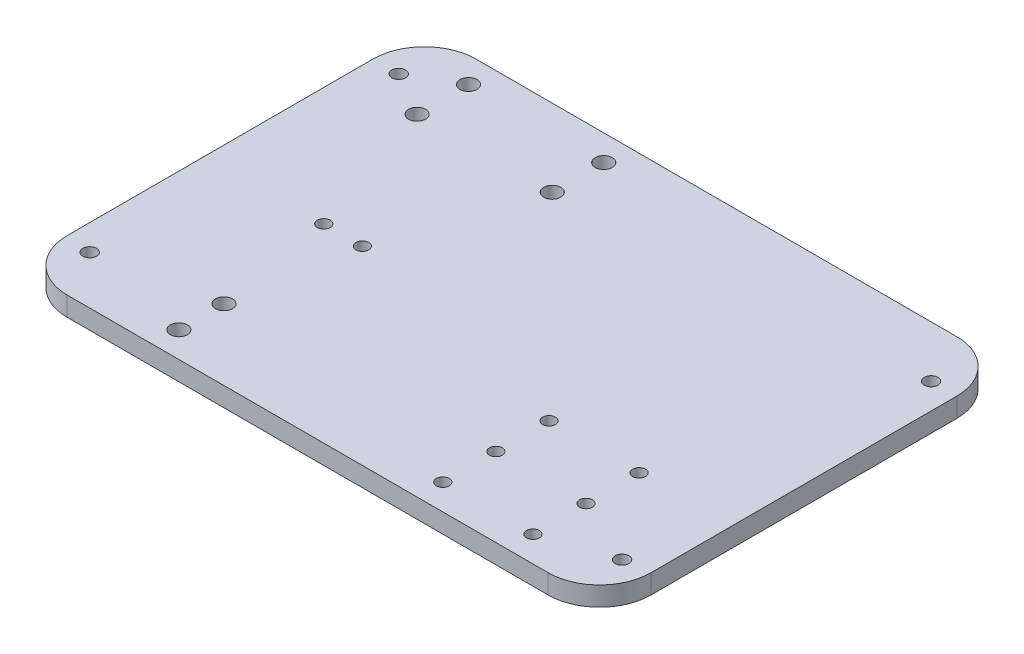
ISO-10303-21;
HEADER;
FILE_DESCRIPTION(('STEP AP214'),'2;1');
FILE_NAME('part.step','',(''),(''),'','','');
FILE_SCHEMA(('AUTOMOTIVE_DESIGN { 1 0 10303 214 1 1 1 1 }'));
ENDSEC;
DATA;
#1=APPLICATION_CONTEXT('core data for automotive mechanical design processes');
#2=APPLICATION_PROTOCOL_DEFINITION('international standard','automotive_design',2000,#1);
#3=PRODUCT_CONTEXT('',#1,'mechanical');
#4=PRODUCT('Part','Part','',(#3));
#5=PRODUCT_RELATED_PRODUCT_CATEGORY('part','',(#4));
#6=PRODUCT_DEFINITION_FORMATION('','',#4);
#7=PRODUCT_DEFINITION_CONTEXT('part definition',#1,'design');
#8=PRODUCT_DEFINITION('design','',#6,#7);
#9=PRODUCT_DEFINITION_SHAPE('','',#8);
#10=(LENGTH_UNIT() NAMED_UNIT(*) SI_UNIT(.MILLI.,.METRE.));
#11=(NAMED_UNIT(*) PLANE_ANGLE_UNIT() SI_UNIT($,.RADIAN.));
#12=(NAMED_UNIT(*) SI_UNIT($,.STERADIAN.) SOLID_ANGLE_UNIT());
#13=UNCERTAINTY_MEASURE_WITH_UNIT(LENGTH_MEASURE(1.E-05),#10,'distance_accuracy_value','');
#14=(GEOMETRIC_REPRESENTATION_CONTEXT(3) GLOBAL_UNCERTAINTY_ASSIGNED_CONTEXT((#13)) GLOBAL_UNIT_ASSIGNED_CONTEXT((#10,
#11,#12)) REPRESENTATION_CONTEXT('',''));
#15=CARTESIAN_POINT('',(0.,0.,0.));
#16=DIRECTION('',(0.,0.,1.));
#17=DIRECTION('',(1.,0.,0.));
#18=AXIS2_PLACEMENT_3D('',#15,#16,#17);
#19=CARTESIAN_POINT('',(143.99895,9.525,100.80625));
#20=DIRECTION('',(-1.,0.,0.));
#21=DIRECTION('',(0.,0.,1.));
#22=AXIS2_PLACEMENT_3D('',#19,#20,#21);
#23=PLANE('',#22);
#24=DIRECTION('',(0.,0.,-1.));
#25=VECTOR('',#24,1.);
#26=CARTESIAN_POINT('',(143.99895,0.,100.80625));
#27=LINE('',#26,#25);
#28=CARTESIAN_POINT('',(143.99895,0.,75.40625));
#29=VERTEX_POINT('',#28);
#30=CARTESIAN_POINT('',(143.99895,0.,-75.40625));
#31=VERTEX_POINT('',#30);
#32=EDGE_CURVE('E132',#29,#31,#27,.T.);
#33=ORIENTED_EDGE('',*,*,#32,.T.);
#34=DIRECTION('',(0.,-1.,0.));
#35=VECTOR('',#34,1.);
#36=CARTESIAN_POINT('',(143.99895,9.525,-75.40625));
#37=LINE('',#36,#35);
#38=CARTESIAN_POINT('',(143.99895,9.525,-75.40625));
#39=VERTEX_POINT('',#38);
#40=EDGE_CURVE('E155',#31,#39,#37,.F.);
#41=ORIENTED_EDGE('',*,*,#40,.T.);
#42=DIRECTION('',(0.,0.,-1.));
#43=VECTOR('',#42,1.);
#44=CARTESIAN_POINT('',(143.99895,9.525,100.80625));
#45=LINE('',#44,#43);
#46=CARTESIAN_POINT('',(143.99895,9.525,75.40625));
#47=VERTEX_POINT('',#46);
#48=EDGE_CURVE('E130',#47,#39,#45,.T.);
#49=ORIENTED_EDGE('',*,*,#48,.F.);
#50=DIRECTION('',(0.,-1.,0.));
#51=VECTOR('',#50,1.);
#52=CARTESIAN_POINT('',(143.99895,9.525,75.40625));
#53=LINE('',#52,#51);
#54=EDGE_CURVE('E152',#47,#29,#53,.T.);
#55=ORIENTED_EDGE('',*,*,#54,.T.);
#56=EDGE_LOOP('',(#33,#41,#49,#55));
#57=FACE_BOUND('',#56,.T.);
#58=ADVANCED_FACE('F35',(#57),#23,.F.);
#59=CARTESIAN_POINT('',(-143.99895,9.525,-100.80625));
#60=DIRECTION('',(0.,0.,1.));
#61=DIRECTION('',(1.,0.,0.));
#62=AXIS2_PLACEMENT_3D('',#59,#60,#61);
#63=PLANE('',#62);
#64=DIRECTION('',(-1.,0.,0.));
#65=VECTOR('',#64,1.);
#66=CARTESIAN_POINT('',(-143.99895,0.,-100.80625));
#67=LINE('',#66,#65);
#68=CARTESIAN_POINT('',(118.59895,0.,-100.80625));
#69=VERTEX_POINT('',#68);
#70=CARTESIAN_POINT('',(-118.59895,0.,-100.80625));
#71=VERTEX_POINT('',#70);
#72=EDGE_CURVE('E128',#69,#71,#67,.T.);
#73=ORIENTED_EDGE('',*,*,#72,.T.);
#74=DIRECTION('',(0.,-1.,0.));
#75=VECTOR('',#74,1.);
#76=CARTESIAN_POINT('',(-118.59895,9.525,-100.80625));
#77=LINE('',#76,#75);
#78=CARTESIAN_POINT('',(-118.59895,9.525,-100.80625));
#79=VERTEX_POINT('',#78);
#80=EDGE_CURVE('E107',#71,#79,#77,.F.);
#81=ORIENTED_EDGE('',*,*,#80,.T.);
#82=DIRECTION('',(-1.,0.,0.));
#83=VECTOR('',#82,1.);
#84=CARTESIAN_POINT('',(-143.99895,9.525,-100.80625));
#85=LINE('',#84,#83);
#86=CARTESIAN_POINT('',(118.59895,9.525,-100.80625));
#87=VERTEX_POINT('',#86);
#88=EDGE_CURVE('E253',#87,#79,#85,.T.);
#89=ORIENTED_EDGE('',*,*,#88,.F.);
#90=DIRECTION('',(0.,-1.,0.));
#91=VECTOR('',#90,1.);
#92=CARTESIAN_POINT('',(118.59895,9.525,-100.80625));
#93=LINE('',#92,#91);
#94=EDGE_CURVE('E112',#87,#69,#93,.T.);
#95=ORIENTED_EDGE('',*,*,#94,.T.);
#96=EDGE_LOOP('',(#73,#81,#89,#95));
#97=FACE_BOUND('',#96,.T.);
#98=ADVANCED_FACE('F270',(#97),#63,.F.);
#99=CARTESIAN_POINT('',(-143.99895,9.525,100.80625));
#100=DIRECTION('',(1.,0.,0.));
#101=DIRECTION('',(0.,0.,-1.));
#102=AXIS2_PLACEMENT_3D('',#99,#100,#101);
#103=PLANE('',#102);
#104=DIRECTION('',(0.,0.,1.));
#105=VECTOR('',#104,1.);
#106=CARTESIAN_POINT('',(-143.99895,9.525,100.80625));
#107=LINE('',#106,#105);
#108=CARTESIAN_POINT('',(-143.99895,9.525,-75.40625));
#109=VERTEX_POINT('',#108);
#110=CARTESIAN_POINT('',(-143.99895,9.525,75.40625));
#111=VERTEX_POINT('',#110);
#112=EDGE_CURVE('E121',#109,#111,#107,.T.);
#113=ORIENTED_EDGE('',*,*,#112,.F.);
#114=DIRECTION('',(0.,-1.,0.));
#115=VECTOR('',#114,1.);
#116=CARTESIAN_POINT('',(-143.99895,9.525,-75.40625));
#117=LINE('',#116,#115);
#118=CARTESIAN_POINT('',(-143.99895,0.,-75.40625));
#119=VERTEX_POINT('',#118);
#120=EDGE_CURVE('E106',#109,#119,#117,.T.);
#121=ORIENTED_EDGE('',*,*,#120,.T.);
#122=DIRECTION('',(0.,0.,1.));
#123=VECTOR('',#122,1.);
#124=CARTESIAN_POINT('',(-143.99895,0.,100.80625));
#125=LINE('',#124,#123);
#126=CARTESIAN_POINT('',(-143.99895,0.,75.40625));
#127=VERTEX_POINT('',#126);
#128=EDGE_CURVE('E119',#119,#127,#125,.T.);
#129=ORIENTED_EDGE('',*,*,#128,.T.);
#130=DIRECTION('',(0.,-1.,0.));
#131=VECTOR('',#130,1.);
#132=CARTESIAN_POINT('',(-143.99895,9.525,75.40625));
#133=LINE('',#132,#131);
#134=EDGE_CURVE('E123',#127,#111,#133,.F.);
#135=ORIENTED_EDGE('',*,*,#134,.T.);
#136=EDGE_LOOP('',(#113,#121,#129,#135));
#137=FACE_BOUND('',#136,.T.);
#138=ADVANCED_FACE('F118',(#137),#103,.F.);
#139=CARTESIAN_POINT('',(-143.99895,9.525,100.80625));
#140=DIRECTION('',(0.,0.,-1.));
#141=DIRECTION('',(-1.,0.,0.));
#142=AXIS2_PLACEMENT_3D('',#139,#140,#141);
#143=PLANE('',#142);
#144=DIRECTION('',(1.,0.,0.));
#145=VECTOR('',#144,1.);
#146=CARTESIAN_POINT('',(-143.99895,0.,100.80625));
#147=LINE('',#146,#145);
#148=CARTESIAN_POINT('',(-118.59895,0.,100.80625));
#149=VERTEX_POINT('',#148);
#150=CARTESIAN_POINT('',(118.59895,0.,100.80625));
#151=VERTEX_POINT('',#150);
#152=EDGE_CURVE('E127',#149,#151,#147,.T.);
#153=ORIENTED_EDGE('',*,*,#152,.T.);
#154=DIRECTION('',(0.,-1.,0.));
#155=VECTOR('',#154,1.);
#156=CARTESIAN_POINT('',(118.59895,9.525,100.80625));
#157=LINE('',#156,#155);
#158=CARTESIAN_POINT('',(118.59895,9.525,100.80625));
#159=VERTEX_POINT('',#158);
#160=EDGE_CURVE('E11',#151,#159,#157,.F.);
#161=ORIENTED_EDGE('',*,*,#160,.T.);
#162=DIRECTION('',(1.,0.,0.));
#163=VECTOR('',#162,1.);
#164=CARTESIAN_POINT('',(-143.99895,9.525,100.80625));
#165=LINE('',#164,#163);
#166=CARTESIAN_POINT('',(-118.59895,9.525,100.80625));
#167=VERTEX_POINT('',#166);
#168=EDGE_CURVE('E136',#167,#159,#165,.T.);
#169=ORIENTED_EDGE('',*,*,#168,.F.);
#170=DIRECTION('',(0.,-1.,0.));
#171=VECTOR('',#170,1.);
#172=CARTESIAN_POINT('',(-118.59895,9.525,100.80625));
#173=LINE('',#172,#171);
#174=EDGE_CURVE('E44',#167,#149,#173,.T.);
#175=ORIENTED_EDGE('',*,*,#174,.T.);
#176=EDGE_LOOP('',(#153,#161,#169,#175));
#177=FACE_BOUND('',#176,.T.);
#178=ADVANCED_FACE('F277',(#177),#143,.F.);
#179=CARTESIAN_POINT('',(0.,9.525,0.));
#180=DIRECTION('',(0.,-1.,0.));
#181=DIRECTION('',(0.,0.,-1.));
#182=AXIS2_PLACEMENT_3D('',#179,#180,#181);
#183=PLANE('',#182);
#184=CARTESIAN_POINT('',(53.975,9.525,35.71875));
#185=DIRECTION('',(0.,1.,0.));
#186=DIRECTION('',(0.,0.,1.));
#187=AXIS2_PLACEMENT_3D('',#184,#185,#186);
#188=CIRCLE('',#187,3.17499999999999);
#189=CARTESIAN_POINT('',(53.975,9.525,38.89375));
#190=VERTEX_POINT('',#189);
#191=EDGE_CURVE('E381',#190,#190,#188,.T.);
#192=ORIENTED_EDGE('',*,*,#191,.F.);
#193=EDGE_LOOP('',(#192));
#194=FACE_BOUND('',#193,.T.);
#195=CARTESIAN_POINT('',(98.425,9.525,35.71875));
#196=DIRECTION('',(0.,1.,0.));
#197=DIRECTION('',(0.,0.,1.));
#198=AXIS2_PLACEMENT_3D('',#195,#196,#197);
#199=CIRCLE('',#198,3.17499999999998);
#200=CARTESIAN_POINT('',(98.425,9.525,38.89375));
#201=VERTEX_POINT('',#200);
#202=EDGE_CURVE('E383',#201,#201,#199,.T.);
#203=ORIENTED_EDGE('',*,*,#202,.F.);
#204=EDGE_LOOP('',(#203));
#205=FACE_BOUND('',#204,.T.);
#206=CARTESIAN_POINT('',(98.425,9.525,61.9125));
#207=DIRECTION('',(0.,1.,0.));
#208=DIRECTION('',(0.,0.,1.));
#209=AXIS2_PLACEMENT_3D('',#206,#207,#208);
#210=CIRCLE('',#209,3.17499999999998);
#211=CARTESIAN_POINT('',(98.425,9.525,65.0875));
#212=VERTEX_POINT('',#211);
#213=EDGE_CURVE('E390',#212,#212,#210,.T.);
#214=ORIENTED_EDGE('',*,*,#213,.F.);
#215=EDGE_LOOP('',(#214));
#216=FACE_BOUND('',#215,.T.);
#217=CARTESIAN_POINT('',(98.425,9.525,88.10625));
#218=DIRECTION('',(0.,1.,0.));
#219=DIRECTION('',(0.,0.,1.));
#220=AXIS2_PLACEMENT_3D('',#217,#218,#219);
#221=CIRCLE('',#220,3.17499999999998);
#222=CARTESIAN_POINT('',(98.425,9.525,91.28125));
#223=VERTEX_POINT('',#222);
#224=EDGE_CURVE('E192',#223,#223,#221,.T.);
#225=ORIENTED_EDGE('',*,*,#224,.F.);
#226=EDGE_LOOP('',(#225));
#227=FACE_BOUND('',#226,.T.);
#228=CARTESIAN_POINT('',(53.975,9.525,88.10625));
#229=DIRECTION('',(0.,1.,0.));
#230=DIRECTION('',(0.,0.,1.));
#231=AXIS2_PLACEMENT_3D('',#228,#229,#230);
#232=CIRCLE('',#231,3.17499999999999);
#233=CARTESIAN_POINT('',(53.975,9.525,91.28125));
#234=VERTEX_POINT('',#233);
#235=EDGE_CURVE('E181',#234,#234,#232,.T.);
#236=ORIENTED_EDGE('',*,*,#235,.F.);
#237=EDGE_LOOP('',(#236));
#238=FACE_BOUND('',#237,.T.);
#239=CARTESIAN_POINT('',(53.975,9.525,61.9125));
#240=DIRECTION('',(0.,1.,0.));
#241=DIRECTION('',(0.,0.,1.));
#242=AXIS2_PLACEMENT_3D('',#239,#240,#241);
#243=CIRCLE('',#242,3.17499999999999);
#244=CARTESIAN_POINT('',(53.975,9.525,65.0875));
#245=VERTEX_POINT('',#244);
#246=EDGE_CURVE('E178',#245,#245,#243,.T.);
#247=ORIENTED_EDGE('',*,*,#246,.F.);
#248=EDGE_LOOP('',(#247));
#249=FACE_BOUND('',#248,.T.);
#250=CARTESIAN_POINT('',(-66.675,9.525,7.14374999999995));
#251=DIRECTION('',(0.,1.,0.));
#252=DIRECTION('',(0.,0.,1.));
#253=AXIS2_PLACEMENT_3D('',#250,#251,#252);
#254=CIRCLE('',#253,3.17499999999998);
#255=CARTESIAN_POINT('',(-66.675,9.525,10.3187499999999));
#256=VERTEX_POINT('',#255);
#257=EDGE_CURVE('E175',#256,#256,#254,.T.);
#258=ORIENTED_EDGE('',*,*,#257,.F.);
#259=EDGE_LOOP('',(#258));
#260=FACE_BOUND('',#259,.T.);
#261=CARTESIAN_POINT('',(-85.725,9.525,7.14374999999995));
#262=DIRECTION('',(0.,1.,0.));
#263=DIRECTION('',(0.,0.,1.));
#264=AXIS2_PLACEMENT_3D('',#261,#262,#263);
#265=CIRCLE('',#264,3.17499999999998);
#266=CARTESIAN_POINT('',(-85.725,9.525,10.3187499999999));
#267=VERTEX_POINT('',#266);
#268=EDGE_CURVE('E171',#267,#267,#265,.T.);
#269=ORIENTED_EDGE('',*,*,#268,.F.);
#270=EDGE_LOOP('',(#269));
#271=FACE_BOUND('',#270,.T.);
#272=CARTESIAN_POINT('',(-76.2,9.525,88.10625));
#273=DIRECTION('',(0.,-1.,0.));
#274=DIRECTION('',(0.,0.,-1.));
#275=AXIS2_PLACEMENT_3D('',#272,#273,#274);
#276=CIRCLE('',#275,4.21639999999999);
#277=CARTESIAN_POINT('',(-76.2,9.525,83.88985));
#278=VERTEX_POINT('',#277);
#279=EDGE_CURVE('E202',#278,#278,#276,.T.);
#280=ORIENTED_EDGE('',*,*,#279,.T.);
#281=EDGE_LOOP('',(#280));
#282=FACE_BOUND('',#281,.T.);
#283=CARTESIAN_POINT('',(-76.2,9.525,65.88125));
#284=DIRECTION('',(0.,-1.,0.));
#285=DIRECTION('',(0.,0.,-1.));
#286=AXIS2_PLACEMENT_3D('',#283,#284,#285);
#287=CIRCLE('',#286,4.21639999999999);
#288=CARTESIAN_POINT('',(-76.2,9.525,61.66485));
#289=VERTEX_POINT('',#288);
#290=EDGE_CURVE('E208',#289,#289,#287,.T.);
#291=ORIENTED_EDGE('',*,*,#290,.T.);
#292=EDGE_LOOP('',(#291));
#293=FACE_BOUND('',#292,.T.);
#294=CARTESIAN_POINT('',(-42.857421778,9.525,-88.10625));
#295=DIRECTION('',(0.,-1.,0.));
#296=DIRECTION('',(0.,0.,-1.));
#297=AXIS2_PLACEMENT_3D('',#294,#295,#296);
#298=CIRCLE('',#297,4.21639999999999);
#299=CARTESIAN_POINT('',(-42.857421778,9.525,-92.32265));
#300=VERTEX_POINT('',#299);
#301=EDGE_CURVE('E214',#300,#300,#298,.T.);
#302=ORIENTED_EDGE('',*,*,#301,.T.);
#303=EDGE_LOOP('',(#302));
#304=FACE_BOUND('',#303,.T.);
#305=CARTESIAN_POINT('',(-109.542578222,9.525,-62.70625));
#306=DIRECTION('',(0.,-1.,0.));
#307=DIRECTION('',(0.,0.,-1.));
#308=AXIS2_PLACEMENT_3D('',#305,#306,#307);
#309=CIRCLE('',#308,4.21639999999999);
#310=CARTESIAN_POINT('',(-109.542578222,9.525,-66.92265));
#311=VERTEX_POINT('',#310);
#312=EDGE_CURVE('E220',#311,#311,#309,.T.);
#313=ORIENTED_EDGE('',*,*,#312,.T.);
#314=EDGE_LOOP('',(#313));
#315=FACE_BOUND('',#314,.T.);
#316=CARTESIAN_POINT('',(-42.857421778,9.525,-62.70625));
#317=DIRECTION('',(0.,-1.,0.));
#318=DIRECTION('',(0.,0.,-1.));
#319=AXIS2_PLACEMENT_3D('',#316,#317,#318);
#320=CIRCLE('',#319,4.21639999999999);
#321=CARTESIAN_POINT('',(-42.857421778,9.525,-66.92265));
#322=VERTEX_POINT('',#321);
#323=EDGE_CURVE('E226',#322,#322,#320,.T.);
#324=ORIENTED_EDGE('',*,*,#323,.T.);
#325=EDGE_LOOP('',(#324));
#326=FACE_BOUND('',#325,.T.);
#327=CARTESIAN_POINT('',(-109.542578222,9.525,-88.10625));
#328=DIRECTION('',(0.,-1.,0.));
#329=DIRECTION('',(0.,0.,-1.));
#330=AXIS2_PLACEMENT_3D('',#327,#328,#329);
#331=CIRCLE('',#330,4.21639999999999);
#332=CARTESIAN_POINT('',(-109.542578222,9.525,-92.32265));
#333=VERTEX_POINT('',#332);
#334=EDGE_CURVE('E232',#333,#333,#331,.T.);
#335=ORIENTED_EDGE('',*,*,#334,.T.);
#336=EDGE_LOOP('',(#335));
#337=FACE_BOUND('',#336,.T.);
#338=CARTESIAN_POINT('',(-131.29895,9.525,-75.40625));
#339=DIRECTION('',(0.,1.,0.));
#340=DIRECTION('',(0.,0.,1.));
#341=AXIS2_PLACEMENT_3D('',#338,#339,#340);
#342=CIRCLE('',#341,3.3782);
#343=CARTESIAN_POINT('',(-131.29895,9.525,-72.02805));
#344=VERTEX_POINT('',#343);
#345=EDGE_CURVE('E235',#344,#344,#342,.T.);
#346=ORIENTED_EDGE('',*,*,#345,.F.);
#347=EDGE_LOOP('',(#346));
#348=FACE_BOUND('',#347,.T.);
#349=CARTESIAN_POINT('',(131.29895,9.525,-75.40625));
#350=DIRECTION('',(0.,1.,0.));
#351=DIRECTION('',(0.,0.,1.));
#352=AXIS2_PLACEMENT_3D('',#349,#350,#351);
#353=CIRCLE('',#352,3.3782);
#354=CARTESIAN_POINT('',(131.29895,9.525,-72.02805));
#355=VERTEX_POINT('',#354);
#356=EDGE_CURVE('E241',#355,#355,#353,.T.);
#357=ORIENTED_EDGE('',*,*,#356,.F.);
#358=EDGE_LOOP('',(#357));
#359=FACE_BOUND('',#358,.T.);
#360=CARTESIAN_POINT('',(131.29895,9.525,76.99375));
#361=DIRECTION('',(0.,1.,0.));
#362=DIRECTION('',(0.,0.,1.));
#363=AXIS2_PLACEMENT_3D('',#360,#361,#362);
#364=CIRCLE('',#363,3.3782);
#365=CARTESIAN_POINT('',(131.29895,9.525,80.37195));
#366=VERTEX_POINT('',#365);
#367=EDGE_CURVE('E166',#366,#366,#364,.T.);
#368=ORIENTED_EDGE('',*,*,#367,.F.);
#369=EDGE_LOOP('',(#368));
#370=FACE_BOUND('',#369,.T.);
#371=CARTESIAN_POINT('',(-131.29895,9.525,76.99375));
#372=DIRECTION('',(0.,1.,0.));
#373=DIRECTION('',(0.,0.,1.));
#374=AXIS2_PLACEMENT_3D('',#371,#372,#373);
#375=CIRCLE('',#374,3.3782);
#376=CARTESIAN_POINT('',(-131.29895,9.525,80.37195));
#377=VERTEX_POINT('',#376);
#378=EDGE_CURVE('E162',#377,#377,#375,.T.);
#379=ORIENTED_EDGE('',*,*,#378,.F.);
#380=EDGE_LOOP('',(#379));
#381=FACE_BOUND('',#380,.T.);
#382=ORIENTED_EDGE('',*,*,#88,.T.);
#383=CARTESIAN_POINT('',(-118.59895,9.525,-75.40625));
#384=DIRECTION('',(0.,-1.,0.));
#385=DIRECTION('',(0.,0.,-1.));
#386=AXIS2_PLACEMENT_3D('',#383,#384,#385);
#387=CIRCLE('',#386,25.4);
#388=EDGE_CURVE('E150',#79,#109,#387,.F.);
#389=ORIENTED_EDGE('',*,*,#388,.T.);
#390=ORIENTED_EDGE('',*,*,#112,.T.);
#391=CARTESIAN_POINT('',(-118.59895,9.525,75.40625));
#392=DIRECTION('',(0.,-1.,0.));
#393=DIRECTION('',(0.,0.,-1.));
#394=AXIS2_PLACEMENT_3D('',#391,#392,#393);
#395=CIRCLE('',#394,25.4);
#396=EDGE_CURVE('E57',#111,#167,#395,.F.);
#397=ORIENTED_EDGE('',*,*,#396,.T.);
#398=ORIENTED_EDGE('',*,*,#168,.T.);
#399=CARTESIAN_POINT('',(118.59895,9.525,75.40625));
#400=DIRECTION('',(0.,-1.,0.));
#401=DIRECTION('',(0.,0.,-1.));
#402=AXIS2_PLACEMENT_3D('',#399,#400,#401);
#403=CIRCLE('',#402,25.4);
#404=EDGE_CURVE('E146',#159,#47,#403,.F.);
#405=ORIENTED_EDGE('',*,*,#404,.T.);
#406=ORIENTED_EDGE('',*,*,#48,.T.);
#407=CARTESIAN_POINT('',(118.59895,9.525,-75.40625));
#408=DIRECTION('',(0.,-1.,0.));
#409=DIRECTION('',(0.,0.,-1.));
#410=AXIS2_PLACEMENT_3D('',#407,#408,#409);
#411=CIRCLE('',#410,25.4);
#412=EDGE_CURVE('E148',#39,#87,#411,.F.);
#413=ORIENTED_EDGE('',*,*,#412,.T.);
#414=EDGE_LOOP('',(#382,#389,#390,#397,#398,#405,#406,#413));
#415=FACE_BOUND('',#414,.T.);
#416=ADVANCED_FACE('F268',(#194,#205,#216,#227,#238,#249,#260,#271,#282,#293,#304,#315,#326,
#337,#348,#359,#370,#381,#415),#183,.F.);
#417=CARTESIAN_POINT('',(0.,0.,0.));
#418=DIRECTION('',(0.,-1.,0.));
#419=DIRECTION('',(0.,0.,-1.));
#420=AXIS2_PLACEMENT_3D('',#417,#418,#419);
#421=PLANE('',#420);
#422=CARTESIAN_POINT('',(53.975,0.,35.71875));
#423=DIRECTION('',(0.,-1.,0.));
#424=DIRECTION('',(0.,0.,-1.));
#425=AXIS2_PLACEMENT_3D('',#422,#423,#424);
#426=CIRCLE('',#425,3.17499999999999);
#427=CARTESIAN_POINT('',(53.975,0.,32.54375));
#428=VERTEX_POINT('',#427);
#429=EDGE_CURVE('E39',#428,#428,#426,.T.);
#430=ORIENTED_EDGE('',*,*,#429,.F.);
#431=EDGE_LOOP('',(#430));
#432=FACE_BOUND('',#431,.T.);
#433=CARTESIAN_POINT('',(98.425,0.,35.71875));
#434=DIRECTION('',(0.,-1.,0.));
#435=DIRECTION('',(0.,0.,-1.));
#436=AXIS2_PLACEMENT_3D('',#433,#434,#435);
#437=CIRCLE('',#436,3.17499999999998);
#438=CARTESIAN_POINT('',(98.425,0.,32.54375));
#439=VERTEX_POINT('',#438);
#440=EDGE_CURVE('E387',#439,#439,#437,.T.);
#441=ORIENTED_EDGE('',*,*,#440,.F.);
#442=EDGE_LOOP('',(#441));
#443=FACE_BOUND('',#442,.T.);
#444=CARTESIAN_POINT('',(98.425,0.,61.9125));
#445=DIRECTION('',(0.,-1.,0.));
#446=DIRECTION('',(0.,0.,-1.));
#447=AXIS2_PLACEMENT_3D('',#444,#445,#446);
#448=CIRCLE('',#447,3.17499999999998);
#449=CARTESIAN_POINT('',(98.425,0.,58.7375));
#450=VERTEX_POINT('',#449);
#451=EDGE_CURVE('E393',#450,#450,#448,.T.);
#452=ORIENTED_EDGE('',*,*,#451,.F.);
#453=EDGE_LOOP('',(#452));
#454=FACE_BOUND('',#453,.T.);
#455=CARTESIAN_POINT('',(98.425,0.,88.10625));
#456=DIRECTION('',(0.,-1.,0.));
#457=DIRECTION('',(0.,0.,-1.));
#458=AXIS2_PLACEMENT_3D('',#455,#456,#457);
#459=CIRCLE('',#458,3.17499999999998);
#460=CARTESIAN_POINT('',(98.425,0.,84.93125));
#461=VERTEX_POINT('',#460);
#462=EDGE_CURVE('E187',#461,#461,#459,.T.);
#463=ORIENTED_EDGE('',*,*,#462,.F.);
#464=EDGE_LOOP('',(#463));
#465=FACE_BOUND('',#464,.T.);
#466=CARTESIAN_POINT('',(53.975,0.,88.10625));
#467=DIRECTION('',(0.,-1.,0.));
#468=DIRECTION('',(0.,0.,-1.));
#469=AXIS2_PLACEMENT_3D('',#466,#467,#468);
#470=CIRCLE('',#469,3.17499999999999);
#471=CARTESIAN_POINT('',(53.975,0.,84.93125));
#472=VERTEX_POINT('',#471);
#473=EDGE_CURVE('E179',#472,#472,#470,.T.);
#474=ORIENTED_EDGE('',*,*,#473,.F.);
#475=EDGE_LOOP('',(#474));
#476=FACE_BOUND('',#475,.T.);
#477=CARTESIAN_POINT('',(53.975,0.,61.9125));
#478=DIRECTION('',(0.,-1.,0.));
#479=DIRECTION('',(0.,0.,-1.));
#480=AXIS2_PLACEMENT_3D('',#477,#478,#479);
#481=CIRCLE('',#480,3.17499999999999);
#482=CARTESIAN_POINT('',(53.975,0.,58.7375));
#483=VERTEX_POINT('',#482);
#484=EDGE_CURVE('E176',#483,#483,#481,.T.);
#485=ORIENTED_EDGE('',*,*,#484,.F.);
#486=EDGE_LOOP('',(#485));
#487=FACE_BOUND('',#486,.T.);
#488=CARTESIAN_POINT('',(-66.675,0.,7.14374999999995));
#489=DIRECTION('',(0.,-1.,0.));
#490=DIRECTION('',(0.,0.,-1.));
#491=AXIS2_PLACEMENT_3D('',#488,#489,#490);
#492=CIRCLE('',#491,3.17499999999998);
#493=CARTESIAN_POINT('',(-66.675,0.,3.96874999999996));
#494=VERTEX_POINT('',#493);
#495=EDGE_CURVE('E172',#494,#494,#492,.T.);
#496=ORIENTED_EDGE('',*,*,#495,.F.);
#497=EDGE_LOOP('',(#496));
#498=FACE_BOUND('',#497,.T.);
#499=CARTESIAN_POINT('',(-85.725,0.,7.14374999999995));
#500=DIRECTION('',(0.,-1.,0.));
#501=DIRECTION('',(0.,0.,-1.));
#502=AXIS2_PLACEMENT_3D('',#499,#500,#501);
#503=CIRCLE('',#502,3.17499999999998);
#504=CARTESIAN_POINT('',(-85.725,0.,3.96874999999996));
#505=VERTEX_POINT('',#504);
#506=EDGE_CURVE('E167',#505,#505,#503,.T.);
#507=ORIENTED_EDGE('',*,*,#506,.F.);
#508=EDGE_LOOP('',(#507));
#509=FACE_BOUND('',#508,.T.);
#510=CARTESIAN_POINT('',(-76.2,0.,88.10625));
#511=DIRECTION('',(0.,-1.,0.));
#512=DIRECTION('',(0.,0.,-1.));
#513=AXIS2_PLACEMENT_3D('',#510,#511,#512);
#514=CIRCLE('',#513,4.21639999999999);
#515=CARTESIAN_POINT('',(-76.2,0.,83.88985));
#516=VERTEX_POINT('',#515);
#517=EDGE_CURVE('E170',#516,#516,#514,.T.);
#518=ORIENTED_EDGE('',*,*,#517,.F.);
#519=EDGE_LOOP('',(#518));
#520=FACE_BOUND('',#519,.T.);
#521=CARTESIAN_POINT('',(-76.2,0.,65.88125));
#522=DIRECTION('',(0.,-1.,0.));
#523=DIRECTION('',(0.,0.,-1.));
#524=AXIS2_PLACEMENT_3D('',#521,#522,#523);
#525=CIRCLE('',#524,4.21639999999998);
#526=CARTESIAN_POINT('',(-76.2,0.,61.66485));
#527=VERTEX_POINT('',#526);
#528=EDGE_CURVE('E205',#527,#527,#525,.T.);
#529=ORIENTED_EDGE('',*,*,#528,.F.);
#530=EDGE_LOOP('',(#529));
#531=FACE_BOUND('',#530,.T.);
#532=CARTESIAN_POINT('',(-42.857421778,0.,-88.10625));
#533=DIRECTION('',(0.,-1.,0.));
#534=DIRECTION('',(0.,0.,-1.));
#535=AXIS2_PLACEMENT_3D('',#532,#533,#534);
#536=CIRCLE('',#535,4.21639999999999);
#537=CARTESIAN_POINT('',(-42.857421778,0.,-92.32265));
#538=VERTEX_POINT('',#537);
#539=EDGE_CURVE('E211',#538,#538,#536,.T.);
#540=ORIENTED_EDGE('',*,*,#539,.F.);
#541=EDGE_LOOP('',(#540));
#542=FACE_BOUND('',#541,.T.);
#543=CARTESIAN_POINT('',(-109.542578222,0.,-62.70625));
#544=DIRECTION('',(0.,-1.,0.));
#545=DIRECTION('',(0.,0.,-1.));
#546=AXIS2_PLACEMENT_3D('',#543,#544,#545);
#547=CIRCLE('',#546,4.21639999999998);
#548=CARTESIAN_POINT('',(-109.542578222,0.,-66.92265));
#549=VERTEX_POINT('',#548);
#550=EDGE_CURVE('E217',#549,#549,#547,.T.);
#551=ORIENTED_EDGE('',*,*,#550,.F.);
#552=EDGE_LOOP('',(#551));
#553=FACE_BOUND('',#552,.T.);
#554=CARTESIAN_POINT('',(-42.857421778,0.,-62.70625));
#555=DIRECTION('',(0.,-1.,0.));
#556=DIRECTION('',(0.,0.,-1.));
#557=AXIS2_PLACEMENT_3D('',#554,#555,#556);
#558=CIRCLE('',#557,4.21639999999999);
#559=CARTESIAN_POINT('',(-42.857421778,0.,-66.92265));
#560=VERTEX_POINT('',#559);
#561=EDGE_CURVE('E223',#560,#560,#558,.T.);
#562=ORIENTED_EDGE('',*,*,#561,.F.);
#563=EDGE_LOOP('',(#562));
#564=FACE_BOUND('',#563,.T.);
#565=CARTESIAN_POINT('',(-109.542578222,0.,-88.10625));
#566=DIRECTION('',(0.,-1.,0.));
#567=DIRECTION('',(0.,0.,-1.));
#568=AXIS2_PLACEMENT_3D('',#565,#566,#567);
#569=CIRCLE('',#568,4.21639999999999);
#570=CARTESIAN_POINT('',(-109.542578222,0.,-92.32265));
#571=VERTEX_POINT('',#570);
#572=EDGE_CURVE('E229',#571,#571,#569,.T.);
#573=ORIENTED_EDGE('',*,*,#572,.F.);
#574=EDGE_LOOP('',(#573));
#575=FACE_BOUND('',#574,.T.);
#576=CARTESIAN_POINT('',(-131.29895,0.,-75.40625));
#577=DIRECTION('',(0.,-1.,0.));
#578=DIRECTION('',(0.,0.,-1.));
#579=AXIS2_PLACEMENT_3D('',#576,#577,#578);
#580=CIRCLE('',#579,3.3782);
#581=CARTESIAN_POINT('',(-131.29895,0.,-78.78445));
#582=VERTEX_POINT('',#581);
#583=EDGE_CURVE('E238',#582,#582,#580,.T.);
#584=ORIENTED_EDGE('',*,*,#583,.F.);
#585=EDGE_LOOP('',(#584));
#586=FACE_BOUND('',#585,.T.);
#587=CARTESIAN_POINT('',(131.29895,0.,-75.40625));
#588=DIRECTION('',(0.,-1.,0.));
#589=DIRECTION('',(0.,0.,-1.));
#590=AXIS2_PLACEMENT_3D('',#587,#588,#589);
#591=CIRCLE('',#590,3.3782);
#592=CARTESIAN_POINT('',(131.29895,0.,-78.78445));
#593=VERTEX_POINT('',#592);
#594=EDGE_CURVE('E244',#593,#593,#591,.T.);
#595=ORIENTED_EDGE('',*,*,#594,.F.);
#596=EDGE_LOOP('',(#595));
#597=FACE_BOUND('',#596,.T.);
#598=CARTESIAN_POINT('',(131.29895,0.,76.99375));
#599=DIRECTION('',(0.,-1.,0.));
#600=DIRECTION('',(0.,0.,-1.));
#601=AXIS2_PLACEMENT_3D('',#598,#599,#600);
#602=CIRCLE('',#601,3.3782);
#603=CARTESIAN_POINT('',(131.29895,0.,73.61555));
#604=VERTEX_POINT('',#603);
#605=EDGE_CURVE('E163',#604,#604,#602,.T.);
#606=ORIENTED_EDGE('',*,*,#605,.F.);
#607=EDGE_LOOP('',(#606));
#608=FACE_BOUND('',#607,.T.);
#609=CARTESIAN_POINT('',(-131.29895,0.,76.99375));
#610=DIRECTION('',(0.,-1.,0.));
#611=DIRECTION('',(0.,0.,-1.));
#612=AXIS2_PLACEMENT_3D('',#609,#610,#611);
#613=CIRCLE('',#612,3.3782);
#614=CARTESIAN_POINT('',(-131.29895,0.,73.61555));
#615=VERTEX_POINT('',#614);
#616=EDGE_CURVE('E159',#615,#615,#613,.T.);
#617=ORIENTED_EDGE('',*,*,#616,.F.);
#618=EDGE_LOOP('',(#617));
#619=FACE_BOUND('',#618,.T.);
#620=ORIENTED_EDGE('',*,*,#128,.F.);
#621=CARTESIAN_POINT('',(-118.59895,0.,-75.40625));
#622=DIRECTION('',(0.,-1.,0.));
#623=DIRECTION('',(0.,0.,-1.));
#624=AXIS2_PLACEMENT_3D('',#621,#622,#623);
#625=CIRCLE('',#624,25.4);
#626=EDGE_CURVE('E102',#119,#71,#625,.T.);
#627=ORIENTED_EDGE('',*,*,#626,.T.);
#628=ORIENTED_EDGE('',*,*,#72,.F.);
#629=CARTESIAN_POINT('',(118.59895,0.,-75.40625));
#630=DIRECTION('',(0.,-1.,0.));
#631=DIRECTION('',(0.,0.,-1.));
#632=AXIS2_PLACEMENT_3D('',#629,#630,#631);
#633=CIRCLE('',#632,25.4);
#634=EDGE_CURVE('E113',#69,#31,#633,.T.);
#635=ORIENTED_EDGE('',*,*,#634,.T.);
#636=ORIENTED_EDGE('',*,*,#32,.F.);
#637=CARTESIAN_POINT('',(118.59895,0.,75.40625));
#638=DIRECTION('',(0.,-1.,0.));
#639=DIRECTION('',(0.,0.,-1.));
#640=AXIS2_PLACEMENT_3D('',#637,#638,#639);
#641=CIRCLE('',#640,25.4);
#642=EDGE_CURVE('E139',#29,#151,#641,.T.);
#643=ORIENTED_EDGE('',*,*,#642,.T.);
#644=ORIENTED_EDGE('',*,*,#152,.F.);
#645=CARTESIAN_POINT('',(-118.59895,0.,75.40625));
#646=DIRECTION('',(0.,-1.,0.));
#647=DIRECTION('',(0.,0.,-1.));
#648=AXIS2_PLACEMENT_3D('',#645,#646,#647);
#649=CIRCLE('',#648,25.4);
#650=EDGE_CURVE('E122',#149,#127,#649,.T.);
#651=ORIENTED_EDGE('',*,*,#650,.T.);
#652=EDGE_LOOP('',(#620,#627,#628,#635,#636,#643,#644,#651));
#653=FACE_BOUND('',#652,.T.);
#654=ADVANCED_FACE('F125',(#432,#443,#454,#465,#476,#487,#498,#509,#520,#531,#542,#553,#564,
#575,#586,#597,#608,#619,#653),#421,.T.);
#655=CARTESIAN_POINT('',(-118.59895,9.525,-75.40625));
#656=DIRECTION('',(0.,-1.,0.));
#657=DIRECTION('',(0.,0.,-1.));
#658=AXIS2_PLACEMENT_3D('',#655,#656,#657);
#659=CYLINDRICAL_SURFACE('',#658,25.4);
#660=ORIENTED_EDGE('',*,*,#388,.F.);
#661=ORIENTED_EDGE('',*,*,#80,.F.);
#662=ORIENTED_EDGE('',*,*,#626,.F.);
#663=ORIENTED_EDGE('',*,*,#120,.F.);
#664=EDGE_LOOP('',(#660,#661,#662,#663));
#665=FACE_BOUND('',#664,.T.);
#666=ADVANCED_FACE('F105',(#665),#659,.T.);
#667=CARTESIAN_POINT('',(118.59895,9.525,-75.40625));
#668=DIRECTION('',(0.,-1.,0.));
#669=DIRECTION('',(0.,0.,-1.));
#670=AXIS2_PLACEMENT_3D('',#667,#668,#669);
#671=CYLINDRICAL_SURFACE('',#670,25.4);
#672=ORIENTED_EDGE('',*,*,#412,.F.);
#673=ORIENTED_EDGE('',*,*,#40,.F.);
#674=ORIENTED_EDGE('',*,*,#634,.F.);
#675=ORIENTED_EDGE('',*,*,#94,.F.);
#676=EDGE_LOOP('',(#672,#673,#674,#675));
#677=FACE_BOUND('',#676,.T.);
#678=ADVANCED_FACE('F265',(#677),#671,.T.);
#679=CARTESIAN_POINT('',(118.59895,9.525,75.40625));
#680=DIRECTION('',(0.,-1.,0.));
#681=DIRECTION('',(0.,0.,-1.));
#682=AXIS2_PLACEMENT_3D('',#679,#680,#681);
#683=CYLINDRICAL_SURFACE('',#682,25.4);
#684=ORIENTED_EDGE('',*,*,#404,.F.);
#685=ORIENTED_EDGE('',*,*,#160,.F.);
#686=ORIENTED_EDGE('',*,*,#642,.F.);
#687=ORIENTED_EDGE('',*,*,#54,.F.);
#688=EDGE_LOOP('',(#684,#685,#686,#687));
#689=FACE_BOUND('',#688,.T.);
#690=ADVANCED_FACE('F285',(#689),#683,.T.);
#691=CARTESIAN_POINT('',(-118.59895,9.525,75.40625));
#692=DIRECTION('',(0.,-1.,0.));
#693=DIRECTION('',(0.,0.,-1.));
#694=AXIS2_PLACEMENT_3D('',#691,#692,#693);
#695=CYLINDRICAL_SURFACE('',#694,25.4);
#696=ORIENTED_EDGE('',*,*,#396,.F.);
#697=ORIENTED_EDGE('',*,*,#134,.F.);
#698=ORIENTED_EDGE('',*,*,#650,.F.);
#699=ORIENTED_EDGE('',*,*,#174,.F.);
#700=EDGE_LOOP('',(#696,#697,#698,#699));
#701=FACE_BOUND('',#700,.T.);
#702=ADVANCED_FACE('F37',(#701),#695,.T.);
#703=CARTESIAN_POINT('',(-131.29895,9.525,76.99375));
#704=DIRECTION('',(0.,1.,0.));
#705=DIRECTION('',(0.,0.,1.));
#706=AXIS2_PLACEMENT_3D('',#703,#704,#705);
#707=CYLINDRICAL_SURFACE('',#706,3.3782);
#708=ORIENTED_EDGE('',*,*,#616,.T.);
#709=EDGE_LOOP('',(#708));
#710=FACE_BOUND('',#709,.T.);
#711=ORIENTED_EDGE('',*,*,#378,.T.);
#712=EDGE_LOOP('',(#711));
#713=FACE_BOUND('',#712,.T.);
#714=ADVANCED_FACE('F291',(#710,#713),#707,.F.);
#715=CARTESIAN_POINT('',(131.29895,9.525,76.99375));
#716=DIRECTION('',(0.,1.,0.));
#717=DIRECTION('',(0.,0.,1.));
#718=AXIS2_PLACEMENT_3D('',#715,#716,#717);
#719=CYLINDRICAL_SURFACE('',#718,3.3782);
#720=ORIENTED_EDGE('',*,*,#605,.T.);
#721=EDGE_LOOP('',(#720));
#722=FACE_BOUND('',#721,.T.);
#723=ORIENTED_EDGE('',*,*,#367,.T.);
#724=EDGE_LOOP('',(#723));
#725=FACE_BOUND('',#724,.T.);
#726=ADVANCED_FACE('F307',(#722,#725),#719,.F.);
#727=CARTESIAN_POINT('',(131.29895,9.525,-75.40625));
#728=DIRECTION('',(0.,1.,0.));
#729=DIRECTION('',(0.,0.,1.));
#730=AXIS2_PLACEMENT_3D('',#727,#728,#729);
#731=CYLINDRICAL_SURFACE('',#730,3.3782);
#732=ORIENTED_EDGE('',*,*,#594,.T.);
#733=EDGE_LOOP('',(#732));
#734=FACE_BOUND('',#733,.T.);
#735=ORIENTED_EDGE('',*,*,#356,.T.);
#736=EDGE_LOOP('',(#735));
#737=FACE_BOUND('',#736,.T.);
#738=ADVANCED_FACE('F311',(#734,#737),#731,.F.);
#739=CARTESIAN_POINT('',(-131.29895,9.525,-75.40625));
#740=DIRECTION('',(0.,1.,0.));
#741=DIRECTION('',(0.,0.,1.));
#742=AXIS2_PLACEMENT_3D('',#739,#740,#741);
#743=CYLINDRICAL_SURFACE('',#742,3.3782);
#744=ORIENTED_EDGE('',*,*,#583,.T.);
#745=EDGE_LOOP('',(#744));
#746=FACE_BOUND('',#745,.T.);
#747=ORIENTED_EDGE('',*,*,#345,.T.);
#748=EDGE_LOOP('',(#747));
#749=FACE_BOUND('',#748,.T.);
#750=ADVANCED_FACE('F315',(#746,#749),#743,.F.);
#751=CARTESIAN_POINT('',(-109.542578222,0.,-88.10625));
#752=DIRECTION('',(0.,-1.,0.));
#753=DIRECTION('',(0.,0.,-1.));
#754=AXIS2_PLACEMENT_3D('',#751,#752,#753);
#755=CYLINDRICAL_SURFACE('',#754,4.21639999999999);
#756=ORIENTED_EDGE('',*,*,#334,.F.);
#757=EDGE_LOOP('',(#756));
#758=FACE_BOUND('',#757,.T.);
#759=ORIENTED_EDGE('',*,*,#572,.T.);
#760=EDGE_LOOP('',(#759));
#761=FACE_BOUND('',#760,.T.);
#762=ADVANCED_FACE('F319',(#758,#761),#755,.F.);
#763=CARTESIAN_POINT('',(-42.857421778,0.,-62.70625));
#764=DIRECTION('',(0.,-1.,0.));
#765=DIRECTION('',(0.,0.,-1.));
#766=AXIS2_PLACEMENT_3D('',#763,#764,#765);
#767=CYLINDRICAL_SURFACE('',#766,4.21639999999999);
#768=ORIENTED_EDGE('',*,*,#323,.F.);
#769=EDGE_LOOP('',(#768));
#770=FACE_BOUND('',#769,.T.);
#771=ORIENTED_EDGE('',*,*,#561,.T.);
#772=EDGE_LOOP('',(#771));
#773=FACE_BOUND('',#772,.T.);
#774=ADVANCED_FACE('F323',(#770,#773),#767,.F.);
#775=CARTESIAN_POINT('',(-109.542578222,0.,-62.70625));
#776=DIRECTION('',(0.,-1.,0.));
#777=DIRECTION('',(0.,0.,-1.));
#778=AXIS2_PLACEMENT_3D('',#775,#776,#777);
#779=CYLINDRICAL_SURFACE('',#778,4.21639999999999);
#780=ORIENTED_EDGE('',*,*,#312,.F.);
#781=EDGE_LOOP('',(#780));
#782=FACE_BOUND('',#781,.T.);
#783=ORIENTED_EDGE('',*,*,#550,.T.);
#784=EDGE_LOOP('',(#783));
#785=FACE_BOUND('',#784,.T.);
#786=ADVANCED_FACE('F327',(#782,#785),#779,.F.);
#787=CARTESIAN_POINT('',(-42.857421778,0.,-88.10625));
#788=DIRECTION('',(0.,-1.,0.));
#789=DIRECTION('',(0.,0.,-1.));
#790=AXIS2_PLACEMENT_3D('',#787,#788,#789);
#791=CYLINDRICAL_SURFACE('',#790,4.21639999999999);
#792=ORIENTED_EDGE('',*,*,#301,.F.);
#793=EDGE_LOOP('',(#792));
#794=FACE_BOUND('',#793,.T.);
#795=ORIENTED_EDGE('',*,*,#539,.T.);
#796=EDGE_LOOP('',(#795));
#797=FACE_BOUND('',#796,.T.);
#798=ADVANCED_FACE('F331',(#794,#797),#791,.F.);
#799=CARTESIAN_POINT('',(-76.2,0.,65.88125));
#800=DIRECTION('',(0.,-1.,0.));
#801=DIRECTION('',(0.,0.,-1.));
#802=AXIS2_PLACEMENT_3D('',#799,#800,#801);
#803=CYLINDRICAL_SURFACE('',#802,4.21639999999999);
#804=ORIENTED_EDGE('',*,*,#290,.F.);
#805=EDGE_LOOP('',(#804));
#806=FACE_BOUND('',#805,.T.);
#807=ORIENTED_EDGE('',*,*,#528,.T.);
#808=EDGE_LOOP('',(#807));
#809=FACE_BOUND('',#808,.T.);
#810=ADVANCED_FACE('F335',(#806,#809),#803,.F.);
#811=CARTESIAN_POINT('',(-76.2,0.,88.10625));
#812=DIRECTION('',(0.,-1.,0.));
#813=DIRECTION('',(0.,0.,-1.));
#814=AXIS2_PLACEMENT_3D('',#811,#812,#813);
#815=CYLINDRICAL_SURFACE('',#814,4.21639999999999);
#816=ORIENTED_EDGE('',*,*,#279,.F.);
#817=EDGE_LOOP('',(#816));
#818=FACE_BOUND('',#817,.T.);
#819=ORIENTED_EDGE('',*,*,#517,.T.);
#820=EDGE_LOOP('',(#819));
#821=FACE_BOUND('',#820,.T.);
#822=ADVANCED_FACE('F339',(#818,#821),#815,.F.);
#823=CARTESIAN_POINT('',(-85.725,9.525,7.14374999999995));
#824=DIRECTION('',(0.,1.,0.));
#825=DIRECTION('',(0.,0.,1.));
#826=AXIS2_PLACEMENT_3D('',#823,#824,#825);
#827=CYLINDRICAL_SURFACE('',#826,3.17499999999998);
#828=ORIENTED_EDGE('',*,*,#506,.T.);
#829=EDGE_LOOP('',(#828));
#830=FACE_BOUND('',#829,.T.);
#831=ORIENTED_EDGE('',*,*,#268,.T.);
#832=EDGE_LOOP('',(#831));
#833=FACE_BOUND('',#832,.T.);
#834=ADVANCED_FACE('F343',(#830,#833),#827,.F.);
#835=CARTESIAN_POINT('',(-66.675,9.525,7.14374999999995));
#836=DIRECTION('',(0.,1.,0.));
#837=DIRECTION('',(0.,0.,1.));
#838=AXIS2_PLACEMENT_3D('',#835,#836,#837);
#839=CYLINDRICAL_SURFACE('',#838,3.17499999999998);
#840=ORIENTED_EDGE('',*,*,#495,.T.);
#841=EDGE_LOOP('',(#840));
#842=FACE_BOUND('',#841,.T.);
#843=ORIENTED_EDGE('',*,*,#257,.T.);
#844=EDGE_LOOP('',(#843));
#845=FACE_BOUND('',#844,.T.);
#846=ADVANCED_FACE('F347',(#842,#845),#839,.F.);
#847=CARTESIAN_POINT('',(53.975,9.525,61.9125));
#848=DIRECTION('',(0.,1.,0.));
#849=DIRECTION('',(0.,0.,1.));
#850=AXIS2_PLACEMENT_3D('',#847,#848,#849);
#851=CYLINDRICAL_SURFACE('',#850,3.17499999999999);
#852=ORIENTED_EDGE('',*,*,#484,.T.);
#853=EDGE_LOOP('',(#852));
#854=FACE_BOUND('',#853,.T.);
#855=ORIENTED_EDGE('',*,*,#246,.T.);
#856=EDGE_LOOP('',(#855));
#857=FACE_BOUND('',#856,.T.);
#858=ADVANCED_FACE('F351',(#854,#857),#851,.F.);
#859=CARTESIAN_POINT('',(53.975,9.525,88.10625));
#860=DIRECTION('',(0.,1.,0.));
#861=DIRECTION('',(0.,0.,1.));
#862=AXIS2_PLACEMENT_3D('',#859,#860,#861);
#863=CYLINDRICAL_SURFACE('',#862,3.17499999999999);
#864=ORIENTED_EDGE('',*,*,#473,.T.);
#865=EDGE_LOOP('',(#864));
#866=FACE_BOUND('',#865,.T.);
#867=ORIENTED_EDGE('',*,*,#235,.T.);
#868=EDGE_LOOP('',(#867));
#869=FACE_BOUND('',#868,.T.);
#870=ADVANCED_FACE('F355',(#866,#869),#863,.F.);
#871=CARTESIAN_POINT('',(98.425,9.525,88.10625));
#872=DIRECTION('',(0.,1.,0.));
#873=DIRECTION('',(0.,0.,1.));
#874=AXIS2_PLACEMENT_3D('',#871,#872,#873);
#875=CYLINDRICAL_SURFACE('',#874,3.17499999999998);
#876=ORIENTED_EDGE('',*,*,#462,.T.);
#877=EDGE_LOOP('',(#876));
#878=FACE_BOUND('',#877,.T.);
#879=ORIENTED_EDGE('',*,*,#224,.T.);
#880=EDGE_LOOP('',(#879));
#881=FACE_BOUND('',#880,.T.);
#882=ADVANCED_FACE('F359',(#878,#881),#875,.F.);
#883=CARTESIAN_POINT('',(98.425,9.525,61.9125));
#884=DIRECTION('',(0.,1.,0.));
#885=DIRECTION('',(0.,0.,1.));
#886=AXIS2_PLACEMENT_3D('',#883,#884,#885);
#887=CYLINDRICAL_SURFACE('',#886,3.17499999999998);
#888=ORIENTED_EDGE('',*,*,#451,.T.);
#889=EDGE_LOOP('',(#888));
#890=FACE_BOUND('',#889,.T.);
#891=ORIENTED_EDGE('',*,*,#213,.T.);
#892=EDGE_LOOP('',(#891));
#893=FACE_BOUND('',#892,.T.);
#894=ADVANCED_FACE('F362',(#890,#893),#887,.F.);
#895=CARTESIAN_POINT('',(98.425,9.525,35.71875));
#896=DIRECTION('',(0.,1.,0.));
#897=DIRECTION('',(0.,0.,1.));
#898=AXIS2_PLACEMENT_3D('',#895,#896,#897);
#899=CYLINDRICAL_SURFACE('',#898,3.17499999999998);
#900=ORIENTED_EDGE('',*,*,#440,.T.);
#901=EDGE_LOOP('',(#900));
#902=FACE_BOUND('',#901,.T.);
#903=ORIENTED_EDGE('',*,*,#202,.T.);
#904=EDGE_LOOP('',(#903));
#905=FACE_BOUND('',#904,.T.);
#906=ADVANCED_FACE('F366',(#902,#905),#899,.F.);
#907=CARTESIAN_POINT('',(53.975,9.525,35.71875));
#908=DIRECTION('',(0.,1.,0.));
#909=DIRECTION('',(0.,0.,1.));
#910=AXIS2_PLACEMENT_3D('',#907,#908,#909);
#911=CYLINDRICAL_SURFACE('',#910,3.17499999999999);
#912=ORIENTED_EDGE('',*,*,#429,.T.);
#913=EDGE_LOOP('',(#912));
#914=FACE_BOUND('',#913,.T.);
#915=ORIENTED_EDGE('',*,*,#191,.T.);
#916=EDGE_LOOP('',(#915));
#917=FACE_BOUND('',#916,.T.);
#918=ADVANCED_FACE('F370',(#914,#917),#911,.F.);
#919=CLOSED_SHELL('',(#58,#98,#138,#178,#416,#654,#666,#678,#690,#702,#714,#726,#738,#750,#762,
#774,#786,#798,#810,#822,#834,#846,#858,#870,#882,#894,#906,#918));
#920=MANIFOLD_SOLID_BREP('B2',#919);
#921=ADVANCED_BREP_SHAPE_REPRESENTATION('',(#18,#920),#14);
#922=SHAPE_DEFINITION_REPRESENTATION(#9,#921);
ENDSEC;
END-ISO-10303-21;
